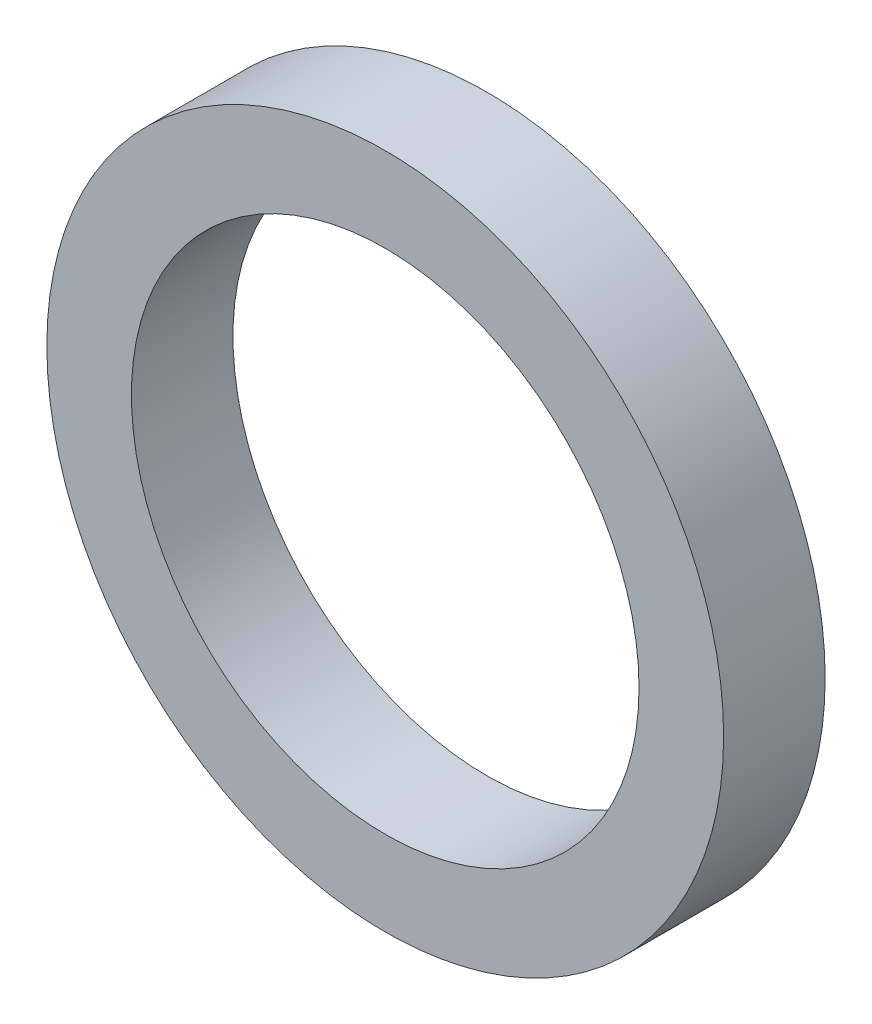
ISO-10303-21;
HEADER;
FILE_DESCRIPTION(('STEP AP214'),'2;1');
FILE_NAME('part.step','',(''),(''),'','','');
FILE_SCHEMA(('AUTOMOTIVE_DESIGN { 1 0 10303 214 1 1 1 1 }'));
ENDSEC;
DATA;
#1=APPLICATION_CONTEXT('core data for automotive mechanical design processes');
#2=APPLICATION_PROTOCOL_DEFINITION('international standard','automotive_design',2000,#1);
#3=PRODUCT_CONTEXT('',#1,'mechanical');
#4=PRODUCT('Part','Part','',(#3));
#5=PRODUCT_RELATED_PRODUCT_CATEGORY('part','',(#4));
#6=PRODUCT_DEFINITION_FORMATION('','',#4);
#7=PRODUCT_DEFINITION_CONTEXT('part definition',#1,'design');
#8=PRODUCT_DEFINITION('design','',#6,#7);
#9=PRODUCT_DEFINITION_SHAPE('','',#8);
#10=(LENGTH_UNIT() NAMED_UNIT(*) SI_UNIT(.MILLI.,.METRE.));
#11=(NAMED_UNIT(*) PLANE_ANGLE_UNIT() SI_UNIT($,.RADIAN.));
#12=(NAMED_UNIT(*) SI_UNIT($,.STERADIAN.) SOLID_ANGLE_UNIT());
#13=UNCERTAINTY_MEASURE_WITH_UNIT(LENGTH_MEASURE(1.E-05),#10,'distance_accuracy_value','');
#14=(GEOMETRIC_REPRESENTATION_CONTEXT(3) GLOBAL_UNCERTAINTY_ASSIGNED_CONTEXT((#13)) GLOBAL_UNIT_ASSIGNED_CONTEXT((#10,
#11,#12)) REPRESENTATION_CONTEXT('',''));
#15=CARTESIAN_POINT('',(0.,0.,0.));
#16=DIRECTION('',(0.,0.,1.));
#17=DIRECTION('',(1.,0.,0.));
#18=AXIS2_PLACEMENT_3D('',#15,#16,#17);
#19=CARTESIAN_POINT('',(0.,0.,1.2));
#20=DIRECTION('',(0.,0.,1.));
#21=DIRECTION('',(1.,0.,0.));
#22=AXIS2_PLACEMENT_3D('',#19,#20,#21);
#23=PLANE('',#22);
#24=CARTESIAN_POINT('',(0.,0.,1.2));
#25=DIRECTION('',(0.,0.,1.));
#26=DIRECTION('',(1.,0.,0.));
#27=AXIS2_PLACEMENT_3D('',#24,#25,#26);
#28=CIRCLE('',#27,4.);
#29=CARTESIAN_POINT('',(4.,0.,1.2));
#30=VERTEX_POINT('',#29);
#31=EDGE_CURVE('E10',#30,#30,#28,.T.);
#32=ORIENTED_EDGE('',*,*,#31,.T.);
#33=EDGE_LOOP('',(#32));
#34=FACE_BOUND('',#33,.T.);
#35=CARTESIAN_POINT('',(0.,0.,1.2));
#36=DIRECTION('',(0.,0.,1.));
#37=DIRECTION('',(1.,0.,0.));
#38=AXIS2_PLACEMENT_3D('',#35,#36,#37);
#39=CIRCLE('',#38,3.);
#40=CARTESIAN_POINT('',(3.,0.,1.2));
#41=VERTEX_POINT('',#40);
#42=EDGE_CURVE('E43',#41,#41,#39,.T.);
#43=ORIENTED_EDGE('',*,*,#42,.F.);
#44=EDGE_LOOP('',(#43));
#45=FACE_BOUND('',#44,.T.);
#46=ADVANCED_FACE('F32',(#34,#45),#23,.T.);
#47=CARTESIAN_POINT('',(0.,0.,0.));
#48=DIRECTION('',(0.,0.,1.));
#49=DIRECTION('',(1.,0.,0.));
#50=AXIS2_PLACEMENT_3D('',#47,#48,#49);
#51=PLANE('',#50);
#52=CARTESIAN_POINT('',(0.,0.,0.));
#53=DIRECTION('',(0.,0.,1.));
#54=DIRECTION('',(1.,0.,0.));
#55=AXIS2_PLACEMENT_3D('',#52,#53,#54);
#56=CIRCLE('',#55,4.);
#57=CARTESIAN_POINT('',(4.,0.,0.));
#58=VERTEX_POINT('',#57);
#59=EDGE_CURVE('E36',#58,#58,#56,.T.);
#60=ORIENTED_EDGE('',*,*,#59,.F.);
#61=EDGE_LOOP('',(#60));
#62=FACE_BOUND('',#61,.T.);
#63=CARTESIAN_POINT('',(0.,0.,0.));
#64=DIRECTION('',(0.,0.,1.));
#65=DIRECTION('',(1.,0.,0.));
#66=AXIS2_PLACEMENT_3D('',#63,#64,#65);
#67=CIRCLE('',#66,3.);
#68=CARTESIAN_POINT('',(3.,0.,0.));
#69=VERTEX_POINT('',#68);
#70=EDGE_CURVE('E45',#69,#69,#67,.T.);
#71=ORIENTED_EDGE('',*,*,#70,.T.);
#72=EDGE_LOOP('',(#71));
#73=FACE_BOUND('',#72,.T.);
#74=ADVANCED_FACE('F55',(#62,#73),#51,.F.);
#75=CARTESIAN_POINT('',(0.,0.,1.2));
#76=DIRECTION('',(0.,0.,-1.));
#77=DIRECTION('',(-1.,0.,0.));
#78=AXIS2_PLACEMENT_3D('',#75,#76,#77);
#79=CYLINDRICAL_SURFACE('',#78,4.);
#80=ORIENTED_EDGE('',*,*,#31,.F.);
#81=EDGE_LOOP('',(#80));
#82=FACE_BOUND('',#81,.T.);
#83=ORIENTED_EDGE('',*,*,#59,.T.);
#84=EDGE_LOOP('',(#83));
#85=FACE_BOUND('',#84,.T.);
#86=ADVANCED_FACE('F34',(#82,#85),#79,.T.);
#87=CARTESIAN_POINT('',(0.,0.,1.2));
#88=DIRECTION('',(0.,0.,-1.));
#89=DIRECTION('',(-1.,0.,0.));
#90=AXIS2_PLACEMENT_3D('',#87,#88,#89);
#91=CYLINDRICAL_SURFACE('',#90,3.);
#92=ORIENTED_EDGE('',*,*,#42,.T.);
#93=EDGE_LOOP('',(#92));
#94=FACE_BOUND('',#93,.T.);
#95=ORIENTED_EDGE('',*,*,#70,.F.);
#96=EDGE_LOOP('',(#95));
#97=FACE_BOUND('',#96,.T.);
#98=ADVANCED_FACE('F51',(#94,#97),#91,.F.);
#99=CLOSED_SHELL('',(#46,#74,#86,#98));
#100=MANIFOLD_SOLID_BREP('B2',#99);
#101=ADVANCED_BREP_SHAPE_REPRESENTATION('',(#18,#100),#14);
#102=SHAPE_DEFINITION_REPRESENTATION(#9,#101);
ENDSEC;
END-ISO-10303-21;
